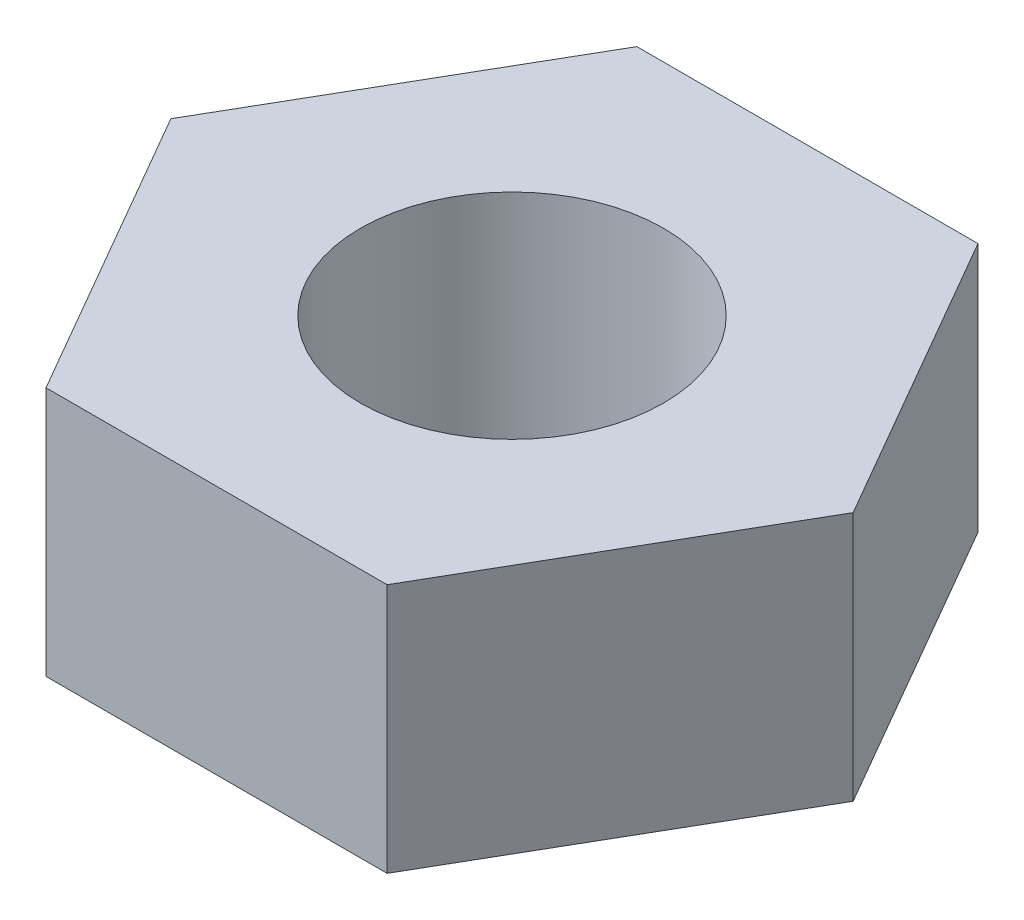
ISO-10303-21;
HEADER;
FILE_DESCRIPTION(('STEP AP214'),'2;1');
FILE_NAME('part.step','',(''),(''),'','','');
FILE_SCHEMA(('AUTOMOTIVE_DESIGN { 1 0 10303 214 1 1 1 1 }'));
ENDSEC;
DATA;
#1=APPLICATION_CONTEXT('core data for automotive mechanical design processes');
#2=APPLICATION_PROTOCOL_DEFINITION('international standard','automotive_design',2000,#1);
#3=PRODUCT_CONTEXT('',#1,'mechanical');
#4=PRODUCT('Part','Part','',(#3));
#5=PRODUCT_RELATED_PRODUCT_CATEGORY('part','',(#4));
#6=PRODUCT_DEFINITION_FORMATION('','',#4);
#7=PRODUCT_DEFINITION_CONTEXT('part definition',#1,'design');
#8=PRODUCT_DEFINITION('design','',#6,#7);
#9=PRODUCT_DEFINITION_SHAPE('','',#8);
#10=(LENGTH_UNIT() NAMED_UNIT(*) SI_UNIT(.MILLI.,.METRE.));
#11=(NAMED_UNIT(*) PLANE_ANGLE_UNIT() SI_UNIT($,.RADIAN.));
#12=(NAMED_UNIT(*) SI_UNIT($,.STERADIAN.) SOLID_ANGLE_UNIT());
#13=UNCERTAINTY_MEASURE_WITH_UNIT(LENGTH_MEASURE(1.E-05),#10,'distance_accuracy_value','');
#14=(GEOMETRIC_REPRESENTATION_CONTEXT(3) GLOBAL_UNCERTAINTY_ASSIGNED_CONTEXT((#13)) GLOBAL_UNIT_ASSIGNED_CONTEXT((#10,
#11,#12)) REPRESENTATION_CONTEXT('',''));
#15=CARTESIAN_POINT('',(0.,0.,0.));
#16=DIRECTION('',(0.,0.,1.));
#17=DIRECTION('',(1.,0.,0.));
#18=AXIS2_PLACEMENT_3D('',#15,#16,#17);
#19=CARTESIAN_POINT('',(0.,1.65,0.));
#20=DIRECTION('',(0.,1.,0.));
#21=DIRECTION('',(0.,0.,1.));
#22=AXIS2_PLACEMENT_3D('',#19,#20,#21);
#23=PLANE('',#22);
#24=DIRECTION('',(0.5,0.,-0.866025403784439));
#25=VECTOR('',#24,1.);
#26=CARTESIAN_POINT('',(1.12583302491977,1.65,1.95));
#27=LINE('',#26,#25);
#28=CARTESIAN_POINT('',(1.12583302491977,1.65,1.95));
#29=VERTEX_POINT('',#28);
#30=CARTESIAN_POINT('',(2.25166604983954,1.65,0.));
#31=VERTEX_POINT('',#30);
#32=EDGE_CURVE('E135',#29,#31,#27,.T.);
#33=ORIENTED_EDGE('',*,*,#32,.T.);
#34=DIRECTION('',(-0.5,0.,-0.866025403784439));
#35=VECTOR('',#34,1.);
#36=CARTESIAN_POINT('',(2.25166604983954,1.65,0.));
#37=LINE('',#36,#35);
#38=CARTESIAN_POINT('',(1.12583302491977,1.65,-1.95));
#39=VERTEX_POINT('',#38);
#40=EDGE_CURVE('E93',#31,#39,#37,.T.);
#41=ORIENTED_EDGE('',*,*,#40,.T.);
#42=DIRECTION('',(-1.,0.,0.));
#43=VECTOR('',#42,1.);
#44=CARTESIAN_POINT('',(1.12583302491977,1.65,-1.95));
#45=LINE('',#44,#43);
#46=CARTESIAN_POINT('',(-1.12583302491977,1.65,-1.95));
#47=VERTEX_POINT('',#46);
#48=EDGE_CURVE('E106',#39,#47,#45,.T.);
#49=ORIENTED_EDGE('',*,*,#48,.T.);
#50=DIRECTION('',(-0.5,0.,0.866025403784439));
#51=VECTOR('',#50,1.);
#52=CARTESIAN_POINT('',(-1.12583302491977,1.65,-1.95));
#53=LINE('',#52,#51);
#54=CARTESIAN_POINT('',(-2.25166604983954,1.65,0.));
#55=VERTEX_POINT('',#54);
#56=EDGE_CURVE('E100',#47,#55,#53,.T.);
#57=ORIENTED_EDGE('',*,*,#56,.T.);
#58=DIRECTION('',(0.5,0.,0.866025403784439));
#59=VECTOR('',#58,1.);
#60=CARTESIAN_POINT('',(-2.25166604983954,1.65,0.));
#61=LINE('',#60,#59);
#62=CARTESIAN_POINT('',(-1.12583302491977,1.65,1.95));
#63=VERTEX_POINT('',#62);
#64=EDGE_CURVE('E104',#55,#63,#61,.T.);
#65=ORIENTED_EDGE('',*,*,#64,.T.);
#66=DIRECTION('',(1.,0.,0.));
#67=VECTOR('',#66,1.);
#68=CARTESIAN_POINT('',(-1.12583302491977,1.65,1.95));
#69=LINE('',#68,#67);
#70=EDGE_CURVE('E56',#63,#29,#69,.T.);
#71=ORIENTED_EDGE('',*,*,#70,.T.);
#72=EDGE_LOOP('',(#33,#41,#49,#57,#65,#71));
#73=FACE_BOUND('',#72,.T.);
#74=CARTESIAN_POINT('',(0.,1.65,0.));
#75=DIRECTION('',(0.,1.,0.));
#76=DIRECTION('',(0.,0.,1.));
#77=AXIS2_PLACEMENT_3D('',#74,#75,#76);
#78=CIRCLE('',#77,1.);
#79=CARTESIAN_POINT('',(0.,1.65,1.));
#80=VERTEX_POINT('',#79);
#81=EDGE_CURVE('E128',#80,#80,#78,.T.);
#82=ORIENTED_EDGE('',*,*,#81,.F.);
#83=EDGE_LOOP('',(#82));
#84=FACE_BOUND('',#83,.T.);
#85=ADVANCED_FACE('F39',(#73,#84),#23,.T.);
#86=CARTESIAN_POINT('',(0.,0.,0.));
#87=DIRECTION('',(0.,1.,0.));
#88=DIRECTION('',(0.,0.,1.));
#89=AXIS2_PLACEMENT_3D('',#86,#87,#88);
#90=PLANE('',#89);
#91=DIRECTION('',(0.5,0.,-0.866025403784439));
#92=VECTOR('',#91,1.);
#93=CARTESIAN_POINT('',(1.12583302491977,0.,1.95));
#94=LINE('',#93,#92);
#95=CARTESIAN_POINT('',(1.12583302491977,0.,1.95));
#96=VERTEX_POINT('',#95);
#97=CARTESIAN_POINT('',(2.25166604983954,0.,0.));
#98=VERTEX_POINT('',#97);
#99=EDGE_CURVE('E124',#96,#98,#94,.T.);
#100=ORIENTED_EDGE('',*,*,#99,.F.);
#101=DIRECTION('',(1.,0.,0.));
#102=VECTOR('',#101,1.);
#103=CARTESIAN_POINT('',(-1.12583302491977,0.,1.95));
#104=LINE('',#103,#102);
#105=CARTESIAN_POINT('',(-1.12583302491977,0.,1.95));
#106=VERTEX_POINT('',#105);
#107=EDGE_CURVE('E85',#106,#96,#104,.T.);
#108=ORIENTED_EDGE('',*,*,#107,.F.);
#109=DIRECTION('',(0.5,0.,0.866025403784439));
#110=VECTOR('',#109,1.);
#111=CARTESIAN_POINT('',(-2.25166604983954,0.,0.));
#112=LINE('',#111,#110);
#113=CARTESIAN_POINT('',(-2.25166604983954,0.,0.));
#114=VERTEX_POINT('',#113);
#115=EDGE_CURVE('E79',#114,#106,#112,.T.);
#116=ORIENTED_EDGE('',*,*,#115,.F.);
#117=DIRECTION('',(-0.5,0.,0.866025403784439));
#118=VECTOR('',#117,1.);
#119=CARTESIAN_POINT('',(-1.12583302491977,0.,-1.95));
#120=LINE('',#119,#118);
#121=CARTESIAN_POINT('',(-1.12583302491977,0.,-1.95));
#122=VERTEX_POINT('',#121);
#123=EDGE_CURVE('E114',#122,#114,#120,.T.);
#124=ORIENTED_EDGE('',*,*,#123,.F.);
#125=DIRECTION('',(-1.,0.,0.));
#126=VECTOR('',#125,1.);
#127=CARTESIAN_POINT('',(1.12583302491977,0.,-1.95));
#128=LINE('',#127,#126);
#129=CARTESIAN_POINT('',(1.12583302491977,0.,-1.95));
#130=VERTEX_POINT('',#129);
#131=EDGE_CURVE('E130',#130,#122,#128,.T.);
#132=ORIENTED_EDGE('',*,*,#131,.F.);
#133=DIRECTION('',(-0.5,0.,-0.866025403784439));
#134=VECTOR('',#133,1.);
#135=CARTESIAN_POINT('',(2.25166604983954,0.,0.));
#136=LINE('',#135,#134);
#137=EDGE_CURVE('E127',#98,#130,#136,.T.);
#138=ORIENTED_EDGE('',*,*,#137,.F.);
#139=EDGE_LOOP('',(#100,#108,#116,#124,#132,#138));
#140=FACE_BOUND('',#139,.T.);
#141=CARTESIAN_POINT('',(0.,0.,0.));
#142=DIRECTION('',(0.,1.,0.));
#143=DIRECTION('',(0.,0.,1.));
#144=AXIS2_PLACEMENT_3D('',#141,#142,#143);
#145=CIRCLE('',#144,1.);
#146=CARTESIAN_POINT('',(0.,0.,1.));
#147=VERTEX_POINT('',#146);
#148=EDGE_CURVE('E228',#147,#147,#145,.T.);
#149=ORIENTED_EDGE('',*,*,#148,.T.);
#150=EDGE_LOOP('',(#149));
#151=FACE_BOUND('',#150,.T.);
#152=ADVANCED_FACE('F144',(#140,#151),#90,.F.);
#153=CARTESIAN_POINT('',(1.12583302491977,1.65,1.95));
#154=DIRECTION('',(-0.866025403784439,0.,-0.5));
#155=DIRECTION('',(-0.5,0.,0.866025403784439));
#156=AXIS2_PLACEMENT_3D('',#153,#154,#155);
#157=PLANE('',#156);
#158=ORIENTED_EDGE('',*,*,#99,.T.);
#159=DIRECTION('',(0.,-1.,0.));
#160=VECTOR('',#159,1.);
#161=CARTESIAN_POINT('',(2.25166604983954,1.65,0.));
#162=LINE('',#161,#160);
#163=EDGE_CURVE('E11',#31,#98,#162,.T.);
#164=ORIENTED_EDGE('',*,*,#163,.F.);
#165=ORIENTED_EDGE('',*,*,#32,.F.);
#166=DIRECTION('',(0.,-1.,0.));
#167=VECTOR('',#166,1.);
#168=CARTESIAN_POINT('',(1.12583302491977,1.65,1.95));
#169=LINE('',#168,#167);
#170=EDGE_CURVE('E120',#29,#96,#169,.T.);
#171=ORIENTED_EDGE('',*,*,#170,.T.);
#172=EDGE_LOOP('',(#158,#164,#165,#171));
#173=FACE_BOUND('',#172,.T.);
#174=ADVANCED_FACE('F41',(#173),#157,.F.);
#175=CARTESIAN_POINT('',(2.25166604983954,1.65,0.));
#176=DIRECTION('',(-0.866025403784439,0.,0.5));
#177=DIRECTION('',(0.5,0.,0.866025403784438));
#178=AXIS2_PLACEMENT_3D('',#175,#176,#177);
#179=PLANE('',#178);
#180=ORIENTED_EDGE('',*,*,#137,.T.);
#181=DIRECTION('',(0.,-1.,0.));
#182=VECTOR('',#181,1.);
#183=CARTESIAN_POINT('',(1.12583302491977,1.65,-1.95));
#184=LINE('',#183,#182);
#185=EDGE_CURVE('E48',#39,#130,#184,.T.);
#186=ORIENTED_EDGE('',*,*,#185,.F.);
#187=ORIENTED_EDGE('',*,*,#40,.F.);
#188=ORIENTED_EDGE('',*,*,#163,.T.);
#189=EDGE_LOOP('',(#180,#186,#187,#188));
#190=FACE_BOUND('',#189,.T.);
#191=ADVANCED_FACE('F169',(#190),#179,.F.);
#192=CARTESIAN_POINT('',(1.12583302491977,1.65,-1.95));
#193=DIRECTION('',(0.,0.,1.));
#194=DIRECTION('',(1.,0.,0.));
#195=AXIS2_PLACEMENT_3D('',#192,#193,#194);
#196=PLANE('',#195);
#197=ORIENTED_EDGE('',*,*,#131,.T.);
#198=DIRECTION('',(0.,-1.,0.));
#199=VECTOR('',#198,1.);
#200=CARTESIAN_POINT('',(-1.12583302491977,1.65,-1.95));
#201=LINE('',#200,#199);
#202=EDGE_CURVE('E115',#47,#122,#201,.T.);
#203=ORIENTED_EDGE('',*,*,#202,.F.);
#204=ORIENTED_EDGE('',*,*,#48,.F.);
#205=ORIENTED_EDGE('',*,*,#185,.T.);
#206=EDGE_LOOP('',(#197,#203,#204,#205));
#207=FACE_BOUND('',#206,.T.);
#208=ADVANCED_FACE('F141',(#207),#196,.F.);
#209=CARTESIAN_POINT('',(-1.12583302491977,1.65,-1.95));
#210=DIRECTION('',(0.866025403784439,0.,0.5));
#211=DIRECTION('',(0.5,0.,-0.866025403784439));
#212=AXIS2_PLACEMENT_3D('',#209,#210,#211);
#213=PLANE('',#212);
#214=ORIENTED_EDGE('',*,*,#123,.T.);
#215=DIRECTION('',(0.,-1.,0.));
#216=VECTOR('',#215,1.);
#217=CARTESIAN_POINT('',(-2.25166604983954,1.65,0.));
#218=LINE('',#217,#216);
#219=EDGE_CURVE('E111',#55,#114,#218,.T.);
#220=ORIENTED_EDGE('',*,*,#219,.F.);
#221=ORIENTED_EDGE('',*,*,#56,.F.);
#222=ORIENTED_EDGE('',*,*,#202,.T.);
#223=EDGE_LOOP('',(#214,#220,#221,#222));
#224=FACE_BOUND('',#223,.T.);
#225=ADVANCED_FACE('F112',(#224),#213,.F.);
#226=CARTESIAN_POINT('',(-2.25166604983954,1.65,0.));
#227=DIRECTION('',(0.866025403784439,0.,-0.5));
#228=DIRECTION('',(-0.5,0.,-0.866025403784439));
#229=AXIS2_PLACEMENT_3D('',#226,#227,#228);
#230=PLANE('',#229);
#231=ORIENTED_EDGE('',*,*,#115,.T.);
#232=DIRECTION('',(0.,-1.,0.));
#233=VECTOR('',#232,1.);
#234=CARTESIAN_POINT('',(-1.12583302491977,1.65,1.95));
#235=LINE('',#234,#233);
#236=EDGE_CURVE('E116',#63,#106,#235,.T.);
#237=ORIENTED_EDGE('',*,*,#236,.F.);
#238=ORIENTED_EDGE('',*,*,#64,.F.);
#239=ORIENTED_EDGE('',*,*,#219,.T.);
#240=EDGE_LOOP('',(#231,#237,#238,#239));
#241=FACE_BOUND('',#240,.T.);
#242=ADVANCED_FACE('F118',(#241),#230,.F.);
#243=CARTESIAN_POINT('',(-1.12583302491977,1.65,1.95));
#244=DIRECTION('',(0.,0.,-1.));
#245=DIRECTION('',(-1.,0.,0.));
#246=AXIS2_PLACEMENT_3D('',#243,#244,#245);
#247=PLANE('',#246);
#248=ORIENTED_EDGE('',*,*,#107,.T.);
#249=ORIENTED_EDGE('',*,*,#170,.F.);
#250=ORIENTED_EDGE('',*,*,#70,.F.);
#251=ORIENTED_EDGE('',*,*,#236,.T.);
#252=EDGE_LOOP('',(#248,#249,#250,#251));
#253=FACE_BOUND('',#252,.T.);
#254=ADVANCED_FACE('F149',(#253),#247,.F.);
#255=CARTESIAN_POINT('',(0.,1.65,0.));
#256=DIRECTION('',(0.,-1.,0.));
#257=DIRECTION('',(0.,0.,-1.));
#258=AXIS2_PLACEMENT_3D('',#255,#256,#257);
#259=CYLINDRICAL_SURFACE('',#258,1.);
#260=ORIENTED_EDGE('',*,*,#81,.T.);
#261=EDGE_LOOP('',(#260));
#262=FACE_BOUND('',#261,.T.);
#263=ORIENTED_EDGE('',*,*,#148,.F.);
#264=EDGE_LOOP('',(#263));
#265=FACE_BOUND('',#264,.T.);
#266=ADVANCED_FACE('F151',(#262,#265),#259,.F.);
#267=CLOSED_SHELL('',(#85,#152,#174,#191,#208,#225,#242,#254,#266));
#268=MANIFOLD_SOLID_BREP('B2',#267);
#269=ADVANCED_BREP_SHAPE_REPRESENTATION('',(#18,#268),#14);
#270=SHAPE_DEFINITION_REPRESENTATION(#9,#269);
ENDSEC;
END-ISO-10303-21;
